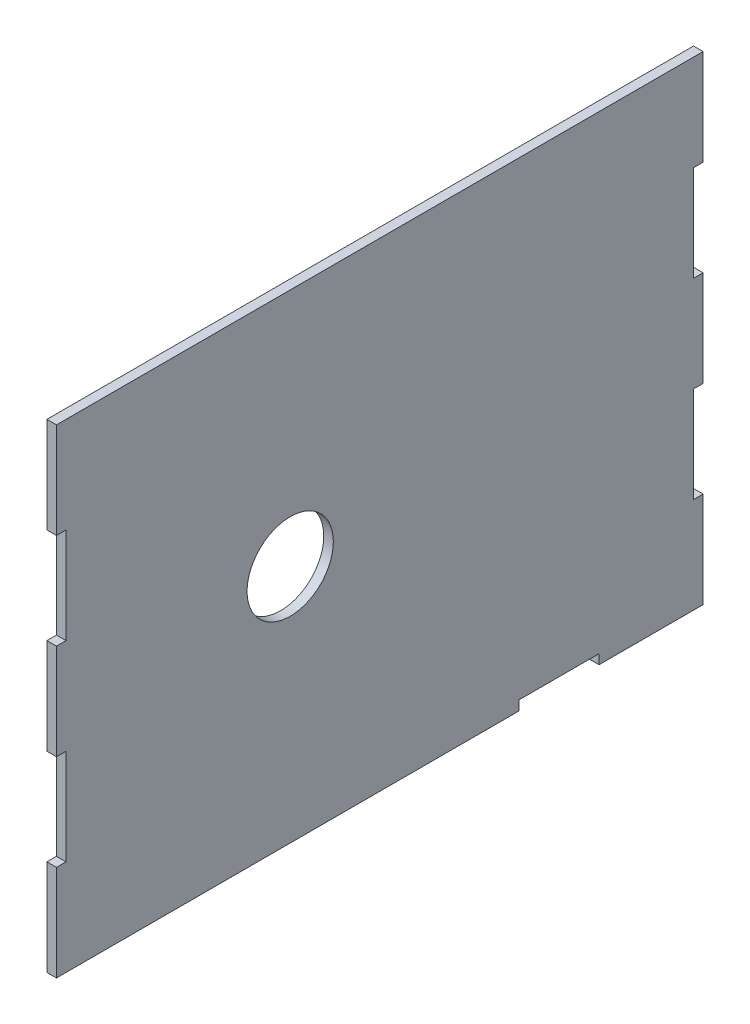
ISO-10303-21;
HEADER;
FILE_DESCRIPTION(('STEP AP214'),'2;1');
FILE_NAME('part.step','',(''),(''),'','','');
FILE_SCHEMA(('AUTOMOTIVE_DESIGN { 1 0 10303 214 1 1 1 1 }'));
ENDSEC;
DATA;
#1=APPLICATION_CONTEXT('core data for automotive mechanical design processes');
#2=APPLICATION_PROTOCOL_DEFINITION('international standard','automotive_design',2000,#1);
#3=PRODUCT_CONTEXT('',#1,'mechanical');
#4=PRODUCT('Part','Part','',(#3));
#5=PRODUCT_RELATED_PRODUCT_CATEGORY('part','',(#4));
#6=PRODUCT_DEFINITION_FORMATION('','',#4);
#7=PRODUCT_DEFINITION_CONTEXT('part definition',#1,'design');
#8=PRODUCT_DEFINITION('design','',#6,#7);
#9=PRODUCT_DEFINITION_SHAPE('','',#8);
#10=(LENGTH_UNIT() NAMED_UNIT(*) SI_UNIT(.MILLI.,.METRE.));
#11=(NAMED_UNIT(*) PLANE_ANGLE_UNIT() SI_UNIT($,.RADIAN.));
#12=(NAMED_UNIT(*) SI_UNIT($,.STERADIAN.) SOLID_ANGLE_UNIT());
#13=UNCERTAINTY_MEASURE_WITH_UNIT(LENGTH_MEASURE(1.E-05),#10,'distance_accuracy_value','');
#14=(GEOMETRIC_REPRESENTATION_CONTEXT(3) GLOBAL_UNCERTAINTY_ASSIGNED_CONTEXT((#13)) GLOBAL_UNIT_ASSIGNED_CONTEXT((#10,
#11,#12)) REPRESENTATION_CONTEXT('',''));
#15=CARTESIAN_POINT('',(0.,0.,0.));
#16=DIRECTION('',(0.,0.,1.));
#17=DIRECTION('',(1.,0.,0.));
#18=AXIS2_PLACEMENT_3D('',#15,#16,#17);
#19=CARTESIAN_POINT('',(2.54,0.,0.));
#20=DIRECTION('',(0.,1.,0.));
#21=DIRECTION('',(0.,0.,1.));
#22=AXIS2_PLACEMENT_3D('',#19,#20,#21);
#23=PLANE('',#22);
#24=DIRECTION('',(1.,0.,0.));
#25=VECTOR('',#24,1.);
#26=CARTESIAN_POINT('',(0.,0.,-122.682));
#27=LINE('',#26,#25);
#28=CARTESIAN_POINT('',(0.,0.,-122.682));
#29=VERTEX_POINT('',#28);
#30=CARTESIAN_POINT('',(2.54,0.,-122.682));
#31=VERTEX_POINT('',#30);
#32=EDGE_CURVE('E202',#29,#31,#27,.T.);
#33=ORIENTED_EDGE('',*,*,#32,.T.);
#34=DIRECTION('',(0.,0.,-1.));
#35=VECTOR('',#34,1.);
#36=CARTESIAN_POINT('',(2.54,0.,0.));
#37=LINE('',#36,#35);
#38=CARTESIAN_POINT('',(2.54,0.,0.));
#39=VERTEX_POINT('',#38);
#40=EDGE_CURVE('E346',#39,#31,#37,.T.);
#41=ORIENTED_EDGE('',*,*,#40,.F.);
#42=DIRECTION('',(-1.,0.,0.));
#43=VECTOR('',#42,1.);
#44=CARTESIAN_POINT('',(2.54,0.,0.));
#45=LINE('',#44,#43);
#46=CARTESIAN_POINT('',(0.,0.,0.));
#47=VERTEX_POINT('',#46);
#48=EDGE_CURVE('E11',#39,#47,#45,.T.);
#49=ORIENTED_EDGE('',*,*,#48,.T.);
#50=DIRECTION('',(0.,0.,-1.));
#51=VECTOR('',#50,1.);
#52=CARTESIAN_POINT('',(0.,0.,0.));
#53=LINE('',#52,#51);
#54=EDGE_CURVE('E362',#47,#29,#53,.T.);
#55=ORIENTED_EDGE('',*,*,#54,.T.);
#56=EDGE_LOOP('',(#33,#41,#49,#55));
#57=FACE_BOUND('',#56,.T.);
#58=ADVANCED_FACE('F37',(#57),#23,.F.);
#59=CARTESIAN_POINT('',(2.54,0.,0.));
#60=DIRECTION('',(0.,0.,-1.));
#61=DIRECTION('',(0.,1.,0.));
#62=AXIS2_PLACEMENT_3D('',#59,#60,#61);
#63=PLANE('',#62);
#64=DIRECTION('',(1.,0.,0.));
#65=VECTOR('',#64,1.);
#66=CARTESIAN_POINT('',(0.,50.8,0.));
#67=LINE('',#66,#65);
#68=CARTESIAN_POINT('',(0.,50.8,0.));
#69=VERTEX_POINT('',#68);
#70=CARTESIAN_POINT('',(2.54,50.8,0.));
#71=VERTEX_POINT('',#70);
#72=EDGE_CURVE('E245',#69,#71,#67,.T.);
#73=ORIENTED_EDGE('',*,*,#72,.T.);
#74=DIRECTION('',(0.,-1.,0.));
#75=VECTOR('',#74,1.);
#76=CARTESIAN_POINT('',(2.54,0.,0.));
#77=LINE('',#76,#75);
#78=CARTESIAN_POINT('',(2.54,76.2,0.));
#79=VERTEX_POINT('',#78);
#80=EDGE_CURVE('E344',#79,#71,#77,.T.);
#81=ORIENTED_EDGE('',*,*,#80,.F.);
#82=DIRECTION('',(1.,0.,0.));
#83=VECTOR('',#82,1.);
#84=CARTESIAN_POINT('',(0.,76.2,0.));
#85=LINE('',#84,#83);
#86=CARTESIAN_POINT('',(0.,76.2,0.));
#87=VERTEX_POINT('',#86);
#88=EDGE_CURVE('E337',#87,#79,#85,.T.);
#89=ORIENTED_EDGE('',*,*,#88,.F.);
#90=DIRECTION('',(0.,-1.,0.));
#91=VECTOR('',#90,1.);
#92=CARTESIAN_POINT('',(0.,0.,0.));
#93=LINE('',#92,#91);
#94=EDGE_CURVE('E361',#87,#69,#93,.T.);
#95=ORIENTED_EDGE('',*,*,#94,.T.);
#96=EDGE_LOOP('',(#73,#81,#89,#95));
#97=FACE_BOUND('',#96,.T.);
#98=ADVANCED_FACE('F412',(#97),#63,.F.);
#99=CARTESIAN_POINT('',(2.54,25.4,0.));
#100=VERTEX_POINT('',#99);
#101=EDGE_CURVE('E345',#100,#39,#77,.T.);
#102=ORIENTED_EDGE('',*,*,#101,.F.);
#103=DIRECTION('',(1.,0.,0.));
#104=VECTOR('',#103,1.);
#105=CARTESIAN_POINT('',(0.,25.4,0.));
#106=LINE('',#105,#104);
#107=CARTESIAN_POINT('',(0.,25.4,0.));
#108=VERTEX_POINT('',#107);
#109=EDGE_CURVE('E248',#108,#100,#106,.T.);
#110=ORIENTED_EDGE('',*,*,#109,.F.);
#111=EDGE_CURVE('E339',#108,#47,#93,.T.);
#112=ORIENTED_EDGE('',*,*,#111,.T.);
#113=ORIENTED_EDGE('',*,*,#48,.F.);
#114=EDGE_LOOP('',(#102,#110,#112,#113));
#115=FACE_BOUND('',#114,.T.);
#116=ADVANCED_FACE('F405',(#115),#63,.F.);
#117=CARTESIAN_POINT('',(2.54,0.,-171.45));
#118=DIRECTION('',(0.,0.,1.));
#119=DIRECTION('',(0.,-1.,0.));
#120=AXIS2_PLACEMENT_3D('',#117,#118,#119);
#121=PLANE('',#120);
#122=DIRECTION('',(1.,0.,0.));
#123=VECTOR('',#122,1.);
#124=CARTESIAN_POINT('',(0.,76.2,-171.45));
#125=LINE('',#124,#123);
#126=CARTESIAN_POINT('',(0.,76.2,-171.45));
#127=VERTEX_POINT('',#126);
#128=CARTESIAN_POINT('',(2.54,76.2,-171.45));
#129=VERTEX_POINT('',#128);
#130=EDGE_CURVE('E299',#127,#129,#125,.T.);
#131=ORIENTED_EDGE('',*,*,#130,.T.);
#132=DIRECTION('',(0.,1.,0.));
#133=VECTOR('',#132,1.);
#134=CARTESIAN_POINT('',(2.54,0.,-171.45));
#135=LINE('',#134,#133);
#136=CARTESIAN_POINT('',(2.54,50.8,-171.45));
#137=VERTEX_POINT('',#136);
#138=EDGE_CURVE('E354',#137,#129,#135,.T.);
#139=ORIENTED_EDGE('',*,*,#138,.F.);
#140=DIRECTION('',(1.,0.,0.));
#141=VECTOR('',#140,1.);
#142=CARTESIAN_POINT('',(0.,50.8,-171.45));
#143=LINE('',#142,#141);
#144=CARTESIAN_POINT('',(0.,50.8,-171.45));
#145=VERTEX_POINT('',#144);
#146=EDGE_CURVE('E273',#145,#137,#143,.T.);
#147=ORIENTED_EDGE('',*,*,#146,.F.);
#148=DIRECTION('',(0.,1.,0.));
#149=VECTOR('',#148,1.);
#150=CARTESIAN_POINT('',(0.,0.,-171.45));
#151=LINE('',#150,#149);
#152=EDGE_CURVE('E369',#145,#127,#151,.T.);
#153=ORIENTED_EDGE('',*,*,#152,.T.);
#154=EDGE_LOOP('',(#131,#139,#147,#153));
#155=FACE_BOUND('',#154,.T.);
#156=ADVANCED_FACE('F448',(#155),#121,.F.);
#157=DIRECTION('',(1.,0.,0.));
#158=VECTOR('',#157,1.);
#159=CARTESIAN_POINT('',(0.,25.4,-171.45));
#160=LINE('',#159,#158);
#161=CARTESIAN_POINT('',(0.,25.4,-171.45));
#162=VERTEX_POINT('',#161);
#163=CARTESIAN_POINT('',(2.54,25.4,-171.45));
#164=VERTEX_POINT('',#163);
#165=EDGE_CURVE('E275',#162,#164,#160,.T.);
#166=ORIENTED_EDGE('',*,*,#165,.T.);
#167=CARTESIAN_POINT('',(2.54,0.,-171.45));
#168=VERTEX_POINT('',#167);
#169=EDGE_CURVE('E350',#168,#164,#135,.T.);
#170=ORIENTED_EDGE('',*,*,#169,.F.);
#171=DIRECTION('',(-1.,0.,0.));
#172=VECTOR('',#171,1.);
#173=CARTESIAN_POINT('',(2.54,0.,-171.45));
#174=LINE('',#173,#172);
#175=CARTESIAN_POINT('',(0.,0.,-171.45));
#176=VERTEX_POINT('',#175);
#177=EDGE_CURVE('E45',#168,#176,#174,.T.);
#178=ORIENTED_EDGE('',*,*,#177,.T.);
#179=EDGE_CURVE('E365',#176,#162,#151,.T.);
#180=ORIENTED_EDGE('',*,*,#179,.T.);
#181=EDGE_LOOP('',(#166,#170,#178,#180));
#182=FACE_BOUND('',#181,.T.);
#183=ADVANCED_FACE('F380',(#182),#121,.F.);
#184=CARTESIAN_POINT('',(2.54,0.,0.));
#185=DIRECTION('',(-1.,0.,0.));
#186=DIRECTION('',(0.,0.,1.));
#187=AXIS2_PLACEMENT_3D('',#184,#185,#186);
#188=PLANE('',#187);
#189=CARTESIAN_POINT('',(2.54,63.5,-61.9759999999999));
#190=DIRECTION('',(1.,0.,0.));
#191=DIRECTION('',(0.,0.,-1.));
#192=AXIS2_PLACEMENT_3D('',#189,#190,#191);
#193=CIRCLE('',#192,11.43);
#194=CARTESIAN_POINT('',(2.54,63.5,-73.4059999999999));
#195=VERTEX_POINT('',#194);
#196=EDGE_CURVE('E230',#195,#195,#193,.T.);
#197=ORIENTED_EDGE('',*,*,#196,.F.);
#198=EDGE_LOOP('',(#197));
#199=FACE_BOUND('',#198,.T.);
#200=DIRECTION('',(0.,0.,1.));
#201=VECTOR('',#200,1.);
#202=CARTESIAN_POINT('',(2.54,2.54,-143.848666666667));
#203=LINE('',#202,#201);
#204=CARTESIAN_POINT('',(2.54,2.54,-143.848666666667));
#205=VERTEX_POINT('',#204);
#206=CARTESIAN_POINT('',(2.54,2.54,-122.682));
#207=VERTEX_POINT('',#206);
#208=EDGE_CURVE('E215',#205,#207,#203,.T.);
#209=ORIENTED_EDGE('',*,*,#208,.F.);
#210=DIRECTION('',(0.,1.,0.));
#211=VECTOR('',#210,1.);
#212=CARTESIAN_POINT('',(2.54,0.,-143.848666666667));
#213=LINE('',#212,#211);
#214=CARTESIAN_POINT('',(2.54,0.,-143.848666666667));
#215=VERTEX_POINT('',#214);
#216=EDGE_CURVE('E220',#215,#205,#213,.T.);
#217=ORIENTED_EDGE('',*,*,#216,.F.);
#218=EDGE_CURVE('E343',#215,#168,#37,.T.);
#219=ORIENTED_EDGE('',*,*,#218,.T.);
#220=ORIENTED_EDGE('',*,*,#169,.T.);
#221=DIRECTION('',(0.,0.,1.));
#222=VECTOR('',#221,1.);
#223=CARTESIAN_POINT('',(2.54,25.4,-171.45));
#224=LINE('',#223,#222);
#225=CARTESIAN_POINT('',(2.54,25.4,-168.91));
#226=VERTEX_POINT('',#225);
#227=EDGE_CURVE('E250',#164,#226,#224,.T.);
#228=ORIENTED_EDGE('',*,*,#227,.T.);
#229=DIRECTION('',(0.,-1.,0.));
#230=VECTOR('',#229,1.);
#231=CARTESIAN_POINT('',(2.54,50.8,-168.91));
#232=LINE('',#231,#230);
#233=CARTESIAN_POINT('',(2.54,50.8,-168.91));
#234=VERTEX_POINT('',#233);
#235=EDGE_CURVE('E282',#234,#226,#232,.T.);
#236=ORIENTED_EDGE('',*,*,#235,.F.);
#237=DIRECTION('',(0.,0.,1.));
#238=VECTOR('',#237,1.);
#239=CARTESIAN_POINT('',(2.54,50.8,-171.45));
#240=LINE('',#239,#238);
#241=EDGE_CURVE('E279',#137,#234,#240,.T.);
#242=ORIENTED_EDGE('',*,*,#241,.F.);
#243=ORIENTED_EDGE('',*,*,#138,.T.);
#244=DIRECTION('',(0.,0.,1.));
#245=VECTOR('',#244,1.);
#246=CARTESIAN_POINT('',(2.54,76.2,-171.45));
#247=LINE('',#246,#245);
#248=CARTESIAN_POINT('',(2.54,76.2,-168.91));
#249=VERTEX_POINT('',#248);
#250=EDGE_CURVE('E271',#129,#249,#247,.T.);
#251=ORIENTED_EDGE('',*,*,#250,.T.);
#252=DIRECTION('',(0.,-1.,0.));
#253=VECTOR('',#252,1.);
#254=CARTESIAN_POINT('',(2.54,101.6,-168.91));
#255=LINE('',#254,#253);
#256=CARTESIAN_POINT('',(2.54,101.6,-168.91));
#257=VERTEX_POINT('',#256);
#258=EDGE_CURVE('E306',#257,#249,#255,.T.);
#259=ORIENTED_EDGE('',*,*,#258,.F.);
#260=DIRECTION('',(0.,0.,1.));
#261=VECTOR('',#260,1.);
#262=CARTESIAN_POINT('',(2.54,101.6,-171.45));
#263=LINE('',#262,#261);
#264=CARTESIAN_POINT('',(2.54,101.6,-171.45));
#265=VERTEX_POINT('',#264);
#266=EDGE_CURVE('E303',#265,#257,#263,.T.);
#267=ORIENTED_EDGE('',*,*,#266,.F.);
#268=CARTESIAN_POINT('',(2.54,127.,-171.45));
#269=VERTEX_POINT('',#268);
#270=EDGE_CURVE('E349',#265,#269,#135,.T.);
#271=ORIENTED_EDGE('',*,*,#270,.T.);
#272=DIRECTION('',(0.,0.,1.));
#273=VECTOR('',#272,1.);
#274=CARTESIAN_POINT('',(2.54,127.,0.));
#275=LINE('',#274,#273);
#276=CARTESIAN_POINT('',(2.54,127.,0.));
#277=VERTEX_POINT('',#276);
#278=EDGE_CURVE('E353',#269,#277,#275,.T.);
#279=ORIENTED_EDGE('',*,*,#278,.T.);
#280=CARTESIAN_POINT('',(2.54,101.6,0.));
#281=VERTEX_POINT('',#280);
#282=EDGE_CURVE('E340',#277,#281,#77,.T.);
#283=ORIENTED_EDGE('',*,*,#282,.T.);
#284=DIRECTION('',(0.,0.,1.));
#285=VECTOR('',#284,1.);
#286=CARTESIAN_POINT('',(2.54,101.6,-2.53999999999994));
#287=LINE('',#286,#285);
#288=CARTESIAN_POINT('',(2.54,101.6,-2.53999999999994));
#289=VERTEX_POINT('',#288);
#290=EDGE_CURVE('E327',#289,#281,#287,.T.);
#291=ORIENTED_EDGE('',*,*,#290,.F.);
#292=DIRECTION('',(0.,-1.,0.));
#293=VECTOR('',#292,1.);
#294=CARTESIAN_POINT('',(2.54,101.6,-2.53999999999994));
#295=LINE('',#294,#293);
#296=CARTESIAN_POINT('',(2.54,76.2,-2.53999999999995));
#297=VERTEX_POINT('',#296);
#298=EDGE_CURVE('E319',#289,#297,#295,.T.);
#299=ORIENTED_EDGE('',*,*,#298,.T.);
#300=DIRECTION('',(0.,0.,1.));
#301=VECTOR('',#300,1.);
#302=CARTESIAN_POINT('',(2.54,76.2,-2.53999999999995));
#303=LINE('',#302,#301);
#304=EDGE_CURVE('E261',#297,#79,#303,.T.);
#305=ORIENTED_EDGE('',*,*,#304,.T.);
#306=ORIENTED_EDGE('',*,*,#80,.T.);
#307=DIRECTION('',(0.,0.,-1.));
#308=VECTOR('',#307,1.);
#309=CARTESIAN_POINT('',(2.54,50.8,0.));
#310=LINE('',#309,#308);
#311=CARTESIAN_POINT('',(2.54,50.8,-2.53999999999994));
#312=VERTEX_POINT('',#311);
#313=EDGE_CURVE('E251',#71,#312,#310,.T.);
#314=ORIENTED_EDGE('',*,*,#313,.T.);
#315=DIRECTION('',(0.,-1.,0.));
#316=VECTOR('',#315,1.);
#317=CARTESIAN_POINT('',(2.54,50.8,-2.53999999999994));
#318=LINE('',#317,#316);
#319=CARTESIAN_POINT('',(2.54,25.4,-2.53999999999995));
#320=VERTEX_POINT('',#319);
#321=EDGE_CURVE('E254',#312,#320,#318,.T.);
#322=ORIENTED_EDGE('',*,*,#321,.T.);
#323=DIRECTION('',(0.,0.,-1.));
#324=VECTOR('',#323,1.);
#325=CARTESIAN_POINT('',(2.54,25.4,0.));
#326=LINE('',#325,#324);
#327=EDGE_CURVE('E258',#100,#320,#326,.T.);
#328=ORIENTED_EDGE('',*,*,#327,.F.);
#329=ORIENTED_EDGE('',*,*,#101,.T.);
#330=ORIENTED_EDGE('',*,*,#40,.T.);
#331=DIRECTION('',(0.,1.,0.));
#332=VECTOR('',#331,1.);
#333=CARTESIAN_POINT('',(2.54,0.,-122.682));
#334=LINE('',#333,#332);
#335=EDGE_CURVE('E52',#31,#207,#334,.T.);
#336=ORIENTED_EDGE('',*,*,#335,.T.);
#337=EDGE_LOOP('',(#209,#217,#219,#220,#228,#236,#242,#243,#251,#259,#267,#271,#279,#283,#291,
#299,#305,#306,#314,#322,#328,#329,#330,#336));
#338=FACE_BOUND('',#337,.T.);
#339=ADVANCED_FACE('F393',(#199,#338),#188,.F.);
#340=CARTESIAN_POINT('',(0.,0.,0.));
#341=DIRECTION('',(-1.,0.,0.));
#342=DIRECTION('',(0.,0.,1.));
#343=AXIS2_PLACEMENT_3D('',#340,#341,#342);
#344=PLANE('',#343);
#345=DIRECTION('',(0.,1.,0.));
#346=VECTOR('',#345,1.);
#347=CARTESIAN_POINT('',(0.,0.,-143.848666666667));
#348=LINE('',#347,#346);
#349=CARTESIAN_POINT('',(0.,0.,-143.848666666667));
#350=VERTEX_POINT('',#349);
#351=CARTESIAN_POINT('',(0.,2.54,-143.848666666667));
#352=VERTEX_POINT('',#351);
#353=EDGE_CURVE('E207',#350,#352,#348,.T.);
#354=ORIENTED_EDGE('',*,*,#353,.T.);
#355=DIRECTION('',(0.,0.,1.));
#356=VECTOR('',#355,1.);
#357=CARTESIAN_POINT('',(0.,2.54,-143.848666666667));
#358=LINE('',#357,#356);
#359=CARTESIAN_POINT('',(0.,2.54,-122.682));
#360=VERTEX_POINT('',#359);
#361=EDGE_CURVE('E208',#352,#360,#358,.T.);
#362=ORIENTED_EDGE('',*,*,#361,.T.);
#363=DIRECTION('',(0.,1.,0.));
#364=VECTOR('',#363,1.);
#365=CARTESIAN_POINT('',(0.,0.,-122.682));
#366=LINE('',#365,#364);
#367=EDGE_CURVE('E197',#29,#360,#366,.T.);
#368=ORIENTED_EDGE('',*,*,#367,.F.);
#369=ORIENTED_EDGE('',*,*,#54,.F.);
#370=ORIENTED_EDGE('',*,*,#111,.F.);
#371=DIRECTION('',(0.,0.,-1.));
#372=VECTOR('',#371,1.);
#373=CARTESIAN_POINT('',(0.,25.4,0.));
#374=LINE('',#373,#372);
#375=CARTESIAN_POINT('',(0.,25.4,-2.53999999999995));
#376=VERTEX_POINT('',#375);
#377=EDGE_CURVE('E255',#108,#376,#374,.T.);
#378=ORIENTED_EDGE('',*,*,#377,.T.);
#379=DIRECTION('',(0.,-1.,0.));
#380=VECTOR('',#379,1.);
#381=CARTESIAN_POINT('',(0.,50.8,-2.53999999999994));
#382=LINE('',#381,#380);
#383=CARTESIAN_POINT('',(0.,50.8,-2.53999999999994));
#384=VERTEX_POINT('',#383);
#385=EDGE_CURVE('E264',#384,#376,#382,.T.);
#386=ORIENTED_EDGE('',*,*,#385,.F.);
#387=DIRECTION('',(0.,0.,-1.));
#388=VECTOR('',#387,1.);
#389=CARTESIAN_POINT('',(0.,50.8,0.));
#390=LINE('',#389,#388);
#391=EDGE_CURVE('E242',#69,#384,#390,.T.);
#392=ORIENTED_EDGE('',*,*,#391,.F.);
#393=ORIENTED_EDGE('',*,*,#94,.F.);
#394=DIRECTION('',(0.,0.,1.));
#395=VECTOR('',#394,1.);
#396=CARTESIAN_POINT('',(0.,76.2,-2.53999999999995));
#397=LINE('',#396,#395);
#398=CARTESIAN_POINT('',(0.,76.2,-2.53999999999995));
#399=VERTEX_POINT('',#398);
#400=EDGE_CURVE('E316',#399,#87,#397,.T.);
#401=ORIENTED_EDGE('',*,*,#400,.F.);
#402=DIRECTION('',(0.,-1.,0.));
#403=VECTOR('',#402,1.);
#404=CARTESIAN_POINT('',(0.,101.6,-2.53999999999994));
#405=LINE('',#404,#403);
#406=CARTESIAN_POINT('',(0.,101.6,-2.53999999999994));
#407=VERTEX_POINT('',#406);
#408=EDGE_CURVE('E322',#407,#399,#405,.T.);
#409=ORIENTED_EDGE('',*,*,#408,.F.);
#410=DIRECTION('',(0.,0.,1.));
#411=VECTOR('',#410,1.);
#412=CARTESIAN_POINT('',(0.,101.6,-2.53999999999994));
#413=LINE('',#412,#411);
#414=CARTESIAN_POINT('',(0.,101.6,0.));
#415=VERTEX_POINT('',#414);
#416=EDGE_CURVE('E318',#407,#415,#413,.T.);
#417=ORIENTED_EDGE('',*,*,#416,.T.);
#418=CARTESIAN_POINT('',(0.,127.,0.));
#419=VERTEX_POINT('',#418);
#420=EDGE_CURVE('E357',#419,#415,#93,.T.);
#421=ORIENTED_EDGE('',*,*,#420,.F.);
#422=DIRECTION('',(0.,0.,1.));
#423=VECTOR('',#422,1.);
#424=CARTESIAN_POINT('',(0.,127.,0.));
#425=LINE('',#424,#423);
#426=CARTESIAN_POINT('',(0.,127.,-171.45));
#427=VERTEX_POINT('',#426);
#428=EDGE_CURVE('E368',#427,#419,#425,.T.);
#429=ORIENTED_EDGE('',*,*,#428,.F.);
#430=CARTESIAN_POINT('',(0.,101.6,-171.45));
#431=VERTEX_POINT('',#430);
#432=EDGE_CURVE('E364',#431,#427,#151,.T.);
#433=ORIENTED_EDGE('',*,*,#432,.F.);
#434=DIRECTION('',(0.,0.,1.));
#435=VECTOR('',#434,1.);
#436=CARTESIAN_POINT('',(0.,101.6,-171.45));
#437=LINE('',#436,#435);
#438=CARTESIAN_POINT('',(0.,101.6,-168.91));
#439=VERTEX_POINT('',#438);
#440=EDGE_CURVE('E302',#431,#439,#437,.T.);
#441=ORIENTED_EDGE('',*,*,#440,.T.);
#442=DIRECTION('',(0.,-1.,0.));
#443=VECTOR('',#442,1.);
#444=CARTESIAN_POINT('',(0.,101.6,-168.91));
#445=LINE('',#444,#443);
#446=CARTESIAN_POINT('',(0.,76.2,-168.91));
#447=VERTEX_POINT('',#446);
#448=EDGE_CURVE('E60',#439,#447,#445,.T.);
#449=ORIENTED_EDGE('',*,*,#448,.T.);
#450=DIRECTION('',(0.,0.,1.));
#451=VECTOR('',#450,1.);
#452=CARTESIAN_POINT('',(0.,76.2,-171.45));
#453=LINE('',#452,#451);
#454=EDGE_CURVE('E307',#127,#447,#453,.T.);
#455=ORIENTED_EDGE('',*,*,#454,.F.);
#456=ORIENTED_EDGE('',*,*,#152,.F.);
#457=DIRECTION('',(0.,0.,1.));
#458=VECTOR('',#457,1.);
#459=CARTESIAN_POINT('',(0.,50.8,-171.45));
#460=LINE('',#459,#458);
#461=CARTESIAN_POINT('',(0.,50.8,-168.91));
#462=VERTEX_POINT('',#461);
#463=EDGE_CURVE('E278',#145,#462,#460,.T.);
#464=ORIENTED_EDGE('',*,*,#463,.T.);
#465=DIRECTION('',(0.,-1.,0.));
#466=VECTOR('',#465,1.);
#467=CARTESIAN_POINT('',(0.,50.8,-168.91));
#468=LINE('',#467,#466);
#469=CARTESIAN_POINT('',(0.,25.4,-168.91));
#470=VERTEX_POINT('',#469);
#471=EDGE_CURVE('E290',#462,#470,#468,.T.);
#472=ORIENTED_EDGE('',*,*,#471,.T.);
#473=DIRECTION('',(0.,0.,1.));
#474=VECTOR('',#473,1.);
#475=CARTESIAN_POINT('',(0.,25.4,-171.45));
#476=LINE('',#475,#474);
#477=EDGE_CURVE('E283',#162,#470,#476,.T.);
#478=ORIENTED_EDGE('',*,*,#477,.F.);
#479=ORIENTED_EDGE('',*,*,#179,.F.);
#480=EDGE_CURVE('E360',#350,#176,#53,.T.);
#481=ORIENTED_EDGE('',*,*,#480,.F.);
#482=EDGE_LOOP('',(#354,#362,#368,#369,#370,#378,#386,#392,#393,#401,#409,#417,#421,#429,#433,
#441,#449,#455,#456,#464,#472,#478,#479,#481));
#483=FACE_BOUND('',#482,.T.);
#484=CARTESIAN_POINT('',(0.,63.5,-61.9759999999999));
#485=DIRECTION('',(1.,0.,0.));
#486=DIRECTION('',(0.,0.,-1.));
#487=AXIS2_PLACEMENT_3D('',#484,#485,#486);
#488=CIRCLE('',#487,11.43);
#489=CARTESIAN_POINT('',(0.,63.5,-73.4059999999999));
#490=VERTEX_POINT('',#489);
#491=EDGE_CURVE('E234',#490,#490,#488,.T.);
#492=ORIENTED_EDGE('',*,*,#491,.T.);
#493=EDGE_LOOP('',(#492));
#494=FACE_BOUND('',#493,.T.);
#495=ADVANCED_FACE('F217',(#483,#494),#344,.T.);
#496=ORIENTED_EDGE('',*,*,#420,.T.);
#497=DIRECTION('',(1.,0.,0.));
#498=VECTOR('',#497,1.);
#499=CARTESIAN_POINT('',(0.,101.6,0.));
#500=LINE('',#499,#498);
#501=EDGE_CURVE('E334',#415,#281,#500,.T.);
#502=ORIENTED_EDGE('',*,*,#501,.T.);
#503=ORIENTED_EDGE('',*,*,#282,.F.);
#504=DIRECTION('',(-1.,0.,0.));
#505=VECTOR('',#504,1.);
#506=CARTESIAN_POINT('',(2.54,127.,0.));
#507=LINE('',#506,#505);
#508=EDGE_CURVE('E356',#277,#419,#507,.T.);
#509=ORIENTED_EDGE('',*,*,#508,.T.);
#510=EDGE_LOOP('',(#496,#502,#503,#509));
#511=FACE_BOUND('',#510,.T.);
#512=ADVANCED_FACE('F39',(#511),#63,.F.);
#513=ORIENTED_EDGE('',*,*,#218,.F.);
#514=DIRECTION('',(1.,0.,0.));
#515=VECTOR('',#514,1.);
#516=CARTESIAN_POINT('',(0.,0.,-143.848666666667));
#517=LINE('',#516,#515);
#518=EDGE_CURVE('E231',#350,#215,#517,.T.);
#519=ORIENTED_EDGE('',*,*,#518,.F.);
#520=ORIENTED_EDGE('',*,*,#480,.T.);
#521=ORIENTED_EDGE('',*,*,#177,.F.);
#522=EDGE_LOOP('',(#513,#519,#520,#521));
#523=FACE_BOUND('',#522,.T.);
#524=ADVANCED_FACE('F396',(#523),#23,.F.);
#525=ORIENTED_EDGE('',*,*,#270,.F.);
#526=DIRECTION('',(1.,0.,0.));
#527=VECTOR('',#526,1.);
#528=CARTESIAN_POINT('',(0.,101.6,-171.45));
#529=LINE('',#528,#527);
#530=EDGE_CURVE('E297',#431,#265,#529,.T.);
#531=ORIENTED_EDGE('',*,*,#530,.F.);
#532=ORIENTED_EDGE('',*,*,#432,.T.);
#533=DIRECTION('',(-1.,0.,0.));
#534=VECTOR('',#533,1.);
#535=CARTESIAN_POINT('',(2.54,127.,-171.45));
#536=LINE('',#535,#534);
#537=EDGE_CURVE('E373',#269,#427,#536,.T.);
#538=ORIENTED_EDGE('',*,*,#537,.F.);
#539=EDGE_LOOP('',(#525,#531,#532,#538));
#540=FACE_BOUND('',#539,.T.);
#541=ADVANCED_FACE('F458',(#540),#121,.F.);
#542=CARTESIAN_POINT('',(2.54,127.,0.));
#543=DIRECTION('',(0.,-1.,0.));
#544=DIRECTION('',(0.,0.,-1.));
#545=AXIS2_PLACEMENT_3D('',#542,#543,#544);
#546=PLANE('',#545);
#547=ORIENTED_EDGE('',*,*,#428,.T.);
#548=ORIENTED_EDGE('',*,*,#508,.F.);
#549=ORIENTED_EDGE('',*,*,#278,.F.);
#550=ORIENTED_EDGE('',*,*,#537,.T.);
#551=EDGE_LOOP('',(#547,#548,#549,#550));
#552=FACE_BOUND('',#551,.T.);
#553=ADVANCED_FACE('F439',(#552),#546,.F.);
#554=CARTESIAN_POINT('',(0.,76.2,-2.53999999999995));
#555=DIRECTION('',(0.,1.,0.));
#556=DIRECTION('',(0.,0.,1.));
#557=AXIS2_PLACEMENT_3D('',#554,#555,#556);
#558=PLANE('',#557);
#559=ORIENTED_EDGE('',*,*,#304,.F.);
#560=DIRECTION('',(1.,0.,0.));
#561=VECTOR('',#560,1.);
#562=CARTESIAN_POINT('',(0.,76.2,-2.53999999999995));
#563=LINE('',#562,#561);
#564=EDGE_CURVE('E324',#399,#297,#563,.T.);
#565=ORIENTED_EDGE('',*,*,#564,.F.);
#566=ORIENTED_EDGE('',*,*,#400,.T.);
#567=ORIENTED_EDGE('',*,*,#88,.T.);
#568=EDGE_LOOP('',(#559,#565,#566,#567));
#569=FACE_BOUND('',#568,.T.);
#570=ADVANCED_FACE('F427',(#569),#558,.T.);
#571=CARTESIAN_POINT('',(0.,101.6,-2.53999999999994));
#572=DIRECTION('',(0.,1.,0.));
#573=DIRECTION('',(0.,0.,1.));
#574=AXIS2_PLACEMENT_3D('',#571,#572,#573);
#575=PLANE('',#574);
#576=ORIENTED_EDGE('',*,*,#290,.T.);
#577=ORIENTED_EDGE('',*,*,#501,.F.);
#578=ORIENTED_EDGE('',*,*,#416,.F.);
#579=DIRECTION('',(1.,0.,0.));
#580=VECTOR('',#579,1.);
#581=CARTESIAN_POINT('',(0.,101.6,-2.53999999999994));
#582=LINE('',#581,#580);
#583=EDGE_CURVE('E332',#407,#289,#582,.T.);
#584=ORIENTED_EDGE('',*,*,#583,.T.);
#585=EDGE_LOOP('',(#576,#577,#578,#584));
#586=FACE_BOUND('',#585,.T.);
#587=ADVANCED_FACE('F488',(#586),#575,.F.);
#588=CARTESIAN_POINT('',(0.,101.6,-2.53999999999994));
#589=DIRECTION('',(0.,0.,1.));
#590=DIRECTION('',(0.,-1.,0.));
#591=AXIS2_PLACEMENT_3D('',#588,#589,#590);
#592=PLANE('',#591);
#593=ORIENTED_EDGE('',*,*,#298,.F.);
#594=ORIENTED_EDGE('',*,*,#583,.F.);
#595=ORIENTED_EDGE('',*,*,#408,.T.);
#596=ORIENTED_EDGE('',*,*,#564,.T.);
#597=EDGE_LOOP('',(#593,#594,#595,#596));
#598=FACE_BOUND('',#597,.T.);
#599=ADVANCED_FACE('F429',(#598),#592,.T.);
#600=CARTESIAN_POINT('',(0.,25.4,0.));
#601=DIRECTION('',(0.,-1.,0.));
#602=DIRECTION('',(0.,0.,-1.));
#603=AXIS2_PLACEMENT_3D('',#600,#601,#602);
#604=PLANE('',#603);
#605=ORIENTED_EDGE('',*,*,#327,.T.);
#606=DIRECTION('',(1.,0.,0.));
#607=VECTOR('',#606,1.);
#608=CARTESIAN_POINT('',(0.,25.4,-2.53999999999995));
#609=LINE('',#608,#607);
#610=EDGE_CURVE('E240',#376,#320,#609,.T.);
#611=ORIENTED_EDGE('',*,*,#610,.F.);
#612=ORIENTED_EDGE('',*,*,#377,.F.);
#613=ORIENTED_EDGE('',*,*,#109,.T.);
#614=EDGE_LOOP('',(#605,#611,#612,#613));
#615=FACE_BOUND('',#614,.T.);
#616=ADVANCED_FACE('F493',(#615),#604,.F.);
#617=CARTESIAN_POINT('',(0.,50.8,0.));
#618=DIRECTION('',(0.,-1.,0.));
#619=DIRECTION('',(0.,0.,-1.));
#620=AXIS2_PLACEMENT_3D('',#617,#618,#619);
#621=PLANE('',#620);
#622=ORIENTED_EDGE('',*,*,#313,.F.);
#623=ORIENTED_EDGE('',*,*,#72,.F.);
#624=ORIENTED_EDGE('',*,*,#391,.T.);
#625=DIRECTION('',(1.,0.,0.));
#626=VECTOR('',#625,1.);
#627=CARTESIAN_POINT('',(0.,50.8,-2.53999999999994));
#628=LINE('',#627,#626);
#629=EDGE_CURVE('E243',#384,#312,#628,.T.);
#630=ORIENTED_EDGE('',*,*,#629,.T.);
#631=EDGE_LOOP('',(#622,#623,#624,#630));
#632=FACE_BOUND('',#631,.T.);
#633=ADVANCED_FACE('F420',(#632),#621,.T.);
#634=CARTESIAN_POINT('',(0.,50.8,-2.53999999999994));
#635=DIRECTION('',(0.,0.,1.));
#636=DIRECTION('',(0.,-1.,0.));
#637=AXIS2_PLACEMENT_3D('',#634,#635,#636);
#638=PLANE('',#637);
#639=ORIENTED_EDGE('',*,*,#321,.F.);
#640=ORIENTED_EDGE('',*,*,#629,.F.);
#641=ORIENTED_EDGE('',*,*,#385,.T.);
#642=ORIENTED_EDGE('',*,*,#610,.T.);
#643=EDGE_LOOP('',(#639,#640,#641,#642));
#644=FACE_BOUND('',#643,.T.);
#645=ADVANCED_FACE('F511',(#644),#638,.T.);
#646=CARTESIAN_POINT('',(0.,25.4,-171.45));
#647=DIRECTION('',(0.,1.,0.));
#648=DIRECTION('',(0.,0.,1.));
#649=AXIS2_PLACEMENT_3D('',#646,#647,#648);
#650=PLANE('',#649);
#651=ORIENTED_EDGE('',*,*,#227,.F.);
#652=ORIENTED_EDGE('',*,*,#165,.F.);
#653=ORIENTED_EDGE('',*,*,#477,.T.);
#654=DIRECTION('',(1.,0.,0.));
#655=VECTOR('',#654,1.);
#656=CARTESIAN_POINT('',(0.,25.4,-168.91));
#657=LINE('',#656,#655);
#658=EDGE_CURVE('E268',#470,#226,#657,.T.);
#659=ORIENTED_EDGE('',*,*,#658,.T.);
#660=EDGE_LOOP('',(#651,#652,#653,#659));
#661=FACE_BOUND('',#660,.T.);
#662=ADVANCED_FACE('F386',(#661),#650,.T.);
#663=CARTESIAN_POINT('',(0.,50.8,-168.91));
#664=DIRECTION('',(0.,0.,1.));
#665=DIRECTION('',(1.,0.,0.));
#666=AXIS2_PLACEMENT_3D('',#663,#664,#665);
#667=PLANE('',#666);
#668=ORIENTED_EDGE('',*,*,#235,.T.);
#669=ORIENTED_EDGE('',*,*,#658,.F.);
#670=ORIENTED_EDGE('',*,*,#471,.F.);
#671=DIRECTION('',(1.,0.,0.));
#672=VECTOR('',#671,1.);
#673=CARTESIAN_POINT('',(0.,50.8,-168.91));
#674=LINE('',#673,#672);
#675=EDGE_CURVE('E270',#462,#234,#674,.T.);
#676=ORIENTED_EDGE('',*,*,#675,.T.);
#677=EDGE_LOOP('',(#668,#669,#670,#676));
#678=FACE_BOUND('',#677,.T.);
#679=ADVANCED_FACE('F388',(#678),#667,.F.);
#680=CARTESIAN_POINT('',(0.,50.8,-171.45));
#681=DIRECTION('',(0.,1.,0.));
#682=DIRECTION('',(0.,0.,1.));
#683=AXIS2_PLACEMENT_3D('',#680,#681,#682);
#684=PLANE('',#683);
#685=ORIENTED_EDGE('',*,*,#241,.T.);
#686=ORIENTED_EDGE('',*,*,#675,.F.);
#687=ORIENTED_EDGE('',*,*,#463,.F.);
#688=ORIENTED_EDGE('',*,*,#146,.T.);
#689=EDGE_LOOP('',(#685,#686,#687,#688));
#690=FACE_BOUND('',#689,.T.);
#691=ADVANCED_FACE('F503',(#690),#684,.F.);
#692=CARTESIAN_POINT('',(0.,76.2,-171.45));
#693=DIRECTION('',(0.,1.,0.));
#694=DIRECTION('',(0.,0.,1.));
#695=AXIS2_PLACEMENT_3D('',#692,#693,#694);
#696=PLANE('',#695);
#697=ORIENTED_EDGE('',*,*,#250,.F.);
#698=ORIENTED_EDGE('',*,*,#130,.F.);
#699=ORIENTED_EDGE('',*,*,#454,.T.);
#700=DIRECTION('',(1.,0.,0.));
#701=VECTOR('',#700,1.);
#702=CARTESIAN_POINT('',(0.,76.2,-168.91));
#703=LINE('',#702,#701);
#704=EDGE_CURVE('E237',#447,#249,#703,.T.);
#705=ORIENTED_EDGE('',*,*,#704,.T.);
#706=EDGE_LOOP('',(#697,#698,#699,#705));
#707=FACE_BOUND('',#706,.T.);
#708=ADVANCED_FACE('F453',(#707),#696,.T.);
#709=CARTESIAN_POINT('',(0.,101.6,-168.91));
#710=DIRECTION('',(0.,0.,1.));
#711=DIRECTION('',(0.,-1.,0.));
#712=AXIS2_PLACEMENT_3D('',#709,#710,#711);
#713=PLANE('',#712);
#714=ORIENTED_EDGE('',*,*,#258,.T.);
#715=ORIENTED_EDGE('',*,*,#704,.F.);
#716=ORIENTED_EDGE('',*,*,#448,.F.);
#717=DIRECTION('',(1.,0.,0.));
#718=VECTOR('',#717,1.);
#719=CARTESIAN_POINT('',(0.,101.6,-168.91));
#720=LINE('',#719,#718);
#721=EDGE_CURVE('E295',#439,#257,#720,.T.);
#722=ORIENTED_EDGE('',*,*,#721,.T.);
#723=EDGE_LOOP('',(#714,#715,#716,#722));
#724=FACE_BOUND('',#723,.T.);
#725=ADVANCED_FACE('F454',(#724),#713,.F.);
#726=CARTESIAN_POINT('',(0.,101.6,-171.45));
#727=DIRECTION('',(0.,1.,0.));
#728=DIRECTION('',(0.,0.,1.));
#729=AXIS2_PLACEMENT_3D('',#726,#727,#728);
#730=PLANE('',#729);
#731=ORIENTED_EDGE('',*,*,#266,.T.);
#732=ORIENTED_EDGE('',*,*,#721,.F.);
#733=ORIENTED_EDGE('',*,*,#440,.F.);
#734=ORIENTED_EDGE('',*,*,#530,.T.);
#735=EDGE_LOOP('',(#731,#732,#733,#734));
#736=FACE_BOUND('',#735,.T.);
#737=ADVANCED_FACE('F494',(#736),#730,.F.);
#738=CARTESIAN_POINT('',(0.,63.5,-61.9759999999999));
#739=DIRECTION('',(1.,0.,0.));
#740=DIRECTION('',(0.,0.,-1.));
#741=AXIS2_PLACEMENT_3D('',#738,#739,#740);
#742=CYLINDRICAL_SURFACE('',#741,11.43);
#743=ORIENTED_EDGE('',*,*,#491,.F.);
#744=EDGE_LOOP('',(#743));
#745=FACE_BOUND('',#744,.T.);
#746=ORIENTED_EDGE('',*,*,#196,.T.);
#747=EDGE_LOOP('',(#746));
#748=FACE_BOUND('',#747,.T.);
#749=ADVANCED_FACE('F497',(#745,#748),#742,.F.);
#750=CARTESIAN_POINT('',(0.,2.54,-143.848666666667));
#751=DIRECTION('',(0.,1.,0.));
#752=DIRECTION('',(0.,0.,1.));
#753=AXIS2_PLACEMENT_3D('',#750,#751,#752);
#754=PLANE('',#753);
#755=ORIENTED_EDGE('',*,*,#208,.T.);
#756=DIRECTION('',(1.,0.,0.));
#757=VECTOR('',#756,1.);
#758=CARTESIAN_POINT('',(0.,2.54,-122.682));
#759=LINE('',#758,#757);
#760=EDGE_CURVE('E200',#360,#207,#759,.T.);
#761=ORIENTED_EDGE('',*,*,#760,.F.);
#762=ORIENTED_EDGE('',*,*,#361,.F.);
#763=DIRECTION('',(1.,0.,0.));
#764=VECTOR('',#763,1.);
#765=CARTESIAN_POINT('',(0.,2.54,-143.848666666667));
#766=LINE('',#765,#764);
#767=EDGE_CURVE('E228',#352,#205,#766,.T.);
#768=ORIENTED_EDGE('',*,*,#767,.T.);
#769=EDGE_LOOP('',(#755,#761,#762,#768));
#770=FACE_BOUND('',#769,.T.);
#771=ADVANCED_FACE('F212',(#770),#754,.F.);
#772=CARTESIAN_POINT('',(0.,0.,-143.848666666667));
#773=DIRECTION('',(0.,0.,-1.));
#774=DIRECTION('',(-1.,0.,0.));
#775=AXIS2_PLACEMENT_3D('',#772,#773,#774);
#776=PLANE('',#775);
#777=ORIENTED_EDGE('',*,*,#216,.T.);
#778=ORIENTED_EDGE('',*,*,#767,.F.);
#779=ORIENTED_EDGE('',*,*,#353,.F.);
#780=ORIENTED_EDGE('',*,*,#518,.T.);
#781=EDGE_LOOP('',(#777,#778,#779,#780));
#782=FACE_BOUND('',#781,.T.);
#783=ADVANCED_FACE('F398',(#782),#776,.F.);
#784=CARTESIAN_POINT('',(0.,0.,-122.682));
#785=DIRECTION('',(0.,0.,-1.));
#786=DIRECTION('',(-1.,0.,0.));
#787=AXIS2_PLACEMENT_3D('',#784,#785,#786);
#788=PLANE('',#787);
#789=ORIENTED_EDGE('',*,*,#335,.F.);
#790=ORIENTED_EDGE('',*,*,#32,.F.);
#791=ORIENTED_EDGE('',*,*,#367,.T.);
#792=ORIENTED_EDGE('',*,*,#760,.T.);
#793=EDGE_LOOP('',(#789,#790,#791,#792));
#794=FACE_BOUND('',#793,.T.);
#795=ADVANCED_FACE('F199',(#794),#788,.T.);
#796=CLOSED_SHELL('',(#58,#98,#116,#156,#183,#339,#495,#512,#524,#541,#553,#570,#587,#599,#616,
#633,#645,#662,#679,#691,#708,#725,#737,#749,#771,#783,#795));
#797=MANIFOLD_SOLID_BREP('B2',#796);
#798=ADVANCED_BREP_SHAPE_REPRESENTATION('',(#18,#797),#14);
#799=SHAPE_DEFINITION_REPRESENTATION(#9,#798);
ENDSEC;
END-ISO-10303-21;
